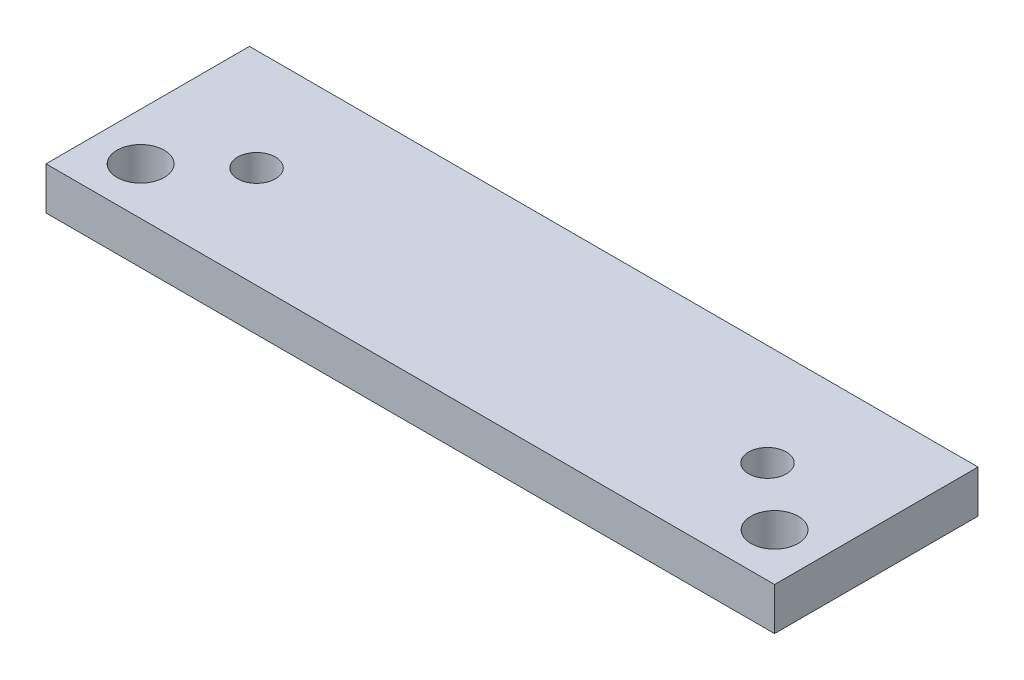
ISO-10303-21;
HEADER;
FILE_DESCRIPTION(('STEP AP214'),'2;1');
FILE_NAME('part.step','',(''),(''),'','','');
FILE_SCHEMA(('AUTOMOTIVE_DESIGN { 1 0 10303 214 1 1 1 1 }'));
ENDSEC;
DATA;
#1=APPLICATION_CONTEXT('core data for automotive mechanical design processes');
#2=APPLICATION_PROTOCOL_DEFINITION('international standard','automotive_design',2000,#1);
#3=PRODUCT_CONTEXT('',#1,'mechanical');
#4=PRODUCT('Part','Part','',(#3));
#5=PRODUCT_RELATED_PRODUCT_CATEGORY('part','',(#4));
#6=PRODUCT_DEFINITION_FORMATION('','',#4);
#7=PRODUCT_DEFINITION_CONTEXT('part definition',#1,'design');
#8=PRODUCT_DEFINITION('design','',#6,#7);
#9=PRODUCT_DEFINITION_SHAPE('','',#8);
#10=(LENGTH_UNIT() NAMED_UNIT(*) SI_UNIT(.MILLI.,.METRE.));
#11=(NAMED_UNIT(*) PLANE_ANGLE_UNIT() SI_UNIT($,.RADIAN.));
#12=(NAMED_UNIT(*) SI_UNIT($,.STERADIAN.) SOLID_ANGLE_UNIT());
#13=UNCERTAINTY_MEASURE_WITH_UNIT(LENGTH_MEASURE(1.E-05),#10,'distance_accuracy_value','');
#14=(GEOMETRIC_REPRESENTATION_CONTEXT(3) GLOBAL_UNCERTAINTY_ASSIGNED_CONTEXT((#13)) GLOBAL_UNIT_ASSIGNED_CONTEXT((#10,
#11,#12)) REPRESENTATION_CONTEXT('',''));
#15=CARTESIAN_POINT('',(0.,0.,0.));
#16=DIRECTION('',(0.,0.,1.));
#17=DIRECTION('',(1.,0.,0.));
#18=AXIS2_PLACEMENT_3D('',#15,#16,#17);
#19=CARTESIAN_POINT('',(0.,4.5,0.));
#20=DIRECTION('',(0.,-1.,0.));
#21=DIRECTION('',(0.,0.,-1.));
#22=AXIS2_PLACEMENT_3D('',#19,#20,#21);
#23=PLANE('',#22);
#24=DIRECTION('',(0.,0.,1.));
#25=VECTOR('',#24,1.);
#26=CARTESIAN_POINT('',(0.,4.5,0.));
#27=LINE('',#26,#25);
#28=CARTESIAN_POINT('',(0.,4.5,-21.5));
#29=VERTEX_POINT('',#28);
#30=CARTESIAN_POINT('',(0.,4.5,0.));
#31=VERTEX_POINT('',#30);
#32=EDGE_CURVE('E98',#29,#31,#27,.T.);
#33=ORIENTED_EDGE('',*,*,#32,.T.);
#34=DIRECTION('',(1.,0.,0.));
#35=VECTOR('',#34,1.);
#36=CARTESIAN_POINT('',(0.,4.5,0.));
#37=LINE('',#36,#35);
#38=CARTESIAN_POINT('',(77.,4.5,0.));
#39=VERTEX_POINT('',#38);
#40=EDGE_CURVE('E93',#31,#39,#37,.T.);
#41=ORIENTED_EDGE('',*,*,#40,.T.);
#42=DIRECTION('',(0.,0.,-1.));
#43=VECTOR('',#42,1.);
#44=CARTESIAN_POINT('',(77.,4.5,0.));
#45=LINE('',#44,#43);
#46=CARTESIAN_POINT('',(77.,4.5,-21.5));
#47=VERTEX_POINT('',#46);
#48=EDGE_CURVE('E96',#39,#47,#45,.T.);
#49=ORIENTED_EDGE('',*,*,#48,.T.);
#50=DIRECTION('',(-1.,0.,0.));
#51=VECTOR('',#50,1.);
#52=CARTESIAN_POINT('',(0.,4.5,-21.5));
#53=LINE('',#52,#51);
#54=EDGE_CURVE('E63',#47,#29,#53,.T.);
#55=ORIENTED_EDGE('',*,*,#54,.T.);
#56=EDGE_LOOP('',(#33,#41,#49,#55));
#57=FACE_BOUND('',#56,.T.);
#58=CARTESIAN_POINT('',(11.5,4.5,-10.75));
#59=DIRECTION('',(0.,1.,0.));
#60=DIRECTION('',(0.,0.,1.));
#61=AXIS2_PLACEMENT_3D('',#58,#59,#60);
#62=CIRCLE('',#61,2.);
#63=CARTESIAN_POINT('',(11.5,4.5,-8.75));
#64=VERTEX_POINT('',#63);
#65=EDGE_CURVE('E118',#64,#64,#62,.T.);
#66=ORIENTED_EDGE('',*,*,#65,.F.);
#67=EDGE_LOOP('',(#66));
#68=FACE_BOUND('',#67,.T.);
#69=CARTESIAN_POINT('',(65.5,4.5,-10.75));
#70=DIRECTION('',(0.,1.,0.));
#71=DIRECTION('',(0.,0.,-1.));
#72=AXIS2_PLACEMENT_3D('',#69,#70,#71);
#73=CIRCLE('',#72,2.);
#74=CARTESIAN_POINT('',(65.5,4.5,-12.75));
#75=VERTEX_POINT('',#74);
#76=EDGE_CURVE('E140',#75,#75,#73,.T.);
#77=ORIENTED_EDGE('',*,*,#76,.F.);
#78=EDGE_LOOP('',(#77));
#79=FACE_BOUND('',#78,.T.);
#80=CARTESIAN_POINT('',(5.,4.5,-5.));
#81=DIRECTION('',(0.,1.,0.));
#82=DIRECTION('',(0.,0.,1.));
#83=AXIS2_PLACEMENT_3D('',#80,#81,#82);
#84=CIRCLE('',#83,2.5);
#85=CARTESIAN_POINT('',(5.,4.5,-2.5));
#86=VERTEX_POINT('',#85);
#87=EDGE_CURVE('E148',#86,#86,#84,.T.);
#88=ORIENTED_EDGE('',*,*,#87,.F.);
#89=EDGE_LOOP('',(#88));
#90=FACE_BOUND('',#89,.T.);
#91=CARTESIAN_POINT('',(72.,4.5,-5.00000000000001));
#92=DIRECTION('',(0.,1.,0.));
#93=DIRECTION('',(0.,0.,-1.));
#94=AXIS2_PLACEMENT_3D('',#91,#92,#93);
#95=CIRCLE('',#94,2.50000000000001);
#96=CARTESIAN_POINT('',(72.,4.5,-7.50000000000002));
#97=VERTEX_POINT('',#96);
#98=EDGE_CURVE('E156',#97,#97,#95,.T.);
#99=ORIENTED_EDGE('',*,*,#98,.F.);
#100=EDGE_LOOP('',(#99));
#101=FACE_BOUND('',#100,.T.);
#102=ADVANCED_FACE('F45',(#57,#68,#79,#90,#101),#23,.F.);
#103=CARTESIAN_POINT('',(0.,0.,0.));
#104=DIRECTION('',(0.,-1.,0.));
#105=DIRECTION('',(0.,0.,-1.));
#106=AXIS2_PLACEMENT_3D('',#103,#104,#105);
#107=PLANE('',#106);
#108=CARTESIAN_POINT('',(5.,0.,-5.));
#109=DIRECTION('',(0.,1.,0.));
#110=DIRECTION('',(0.,0.,1.));
#111=AXIS2_PLACEMENT_3D('',#108,#109,#110);
#112=CIRCLE('',#111,2.5);
#113=CARTESIAN_POINT('',(5.,0.,-2.5));
#114=VERTEX_POINT('',#113);
#115=EDGE_CURVE('E152',#114,#114,#112,.T.);
#116=ORIENTED_EDGE('',*,*,#115,.T.);
#117=EDGE_LOOP('',(#116));
#118=FACE_BOUND('',#117,.T.);
#119=CARTESIAN_POINT('',(11.5,0.,-10.75));
#120=DIRECTION('',(0.,1.,0.));
#121=DIRECTION('',(0.,0.,1.));
#122=AXIS2_PLACEMENT_3D('',#119,#120,#121);
#123=CIRCLE('',#122,2.);
#124=CARTESIAN_POINT('',(11.5,0.,-8.75));
#125=VERTEX_POINT('',#124);
#126=EDGE_CURVE('E136',#125,#125,#123,.T.);
#127=ORIENTED_EDGE('',*,*,#126,.T.);
#128=EDGE_LOOP('',(#127));
#129=FACE_BOUND('',#128,.T.);
#130=DIRECTION('',(0.,0.,1.));
#131=VECTOR('',#130,1.);
#132=CARTESIAN_POINT('',(0.,0.,0.));
#133=LINE('',#132,#131);
#134=CARTESIAN_POINT('',(0.,0.,-21.5));
#135=VERTEX_POINT('',#134);
#136=CARTESIAN_POINT('',(0.,0.,0.));
#137=VERTEX_POINT('',#136);
#138=EDGE_CURVE('E114',#135,#137,#133,.T.);
#139=ORIENTED_EDGE('',*,*,#138,.F.);
#140=DIRECTION('',(-1.,0.,0.));
#141=VECTOR('',#140,1.);
#142=CARTESIAN_POINT('',(0.,0.,-21.5));
#143=LINE('',#142,#141);
#144=CARTESIAN_POINT('',(77.,0.,-21.5));
#145=VERTEX_POINT('',#144);
#146=EDGE_CURVE('E86',#145,#135,#143,.T.);
#147=ORIENTED_EDGE('',*,*,#146,.F.);
#148=DIRECTION('',(0.,0.,-1.));
#149=VECTOR('',#148,1.);
#150=CARTESIAN_POINT('',(77.,0.,0.));
#151=LINE('',#150,#149);
#152=CARTESIAN_POINT('',(77.,0.,0.));
#153=VERTEX_POINT('',#152);
#154=EDGE_CURVE('E80',#153,#145,#151,.T.);
#155=ORIENTED_EDGE('',*,*,#154,.F.);
#156=DIRECTION('',(1.,0.,0.));
#157=VECTOR('',#156,1.);
#158=CARTESIAN_POINT('',(0.,0.,0.));
#159=LINE('',#158,#157);
#160=EDGE_CURVE('E103',#137,#153,#159,.T.);
#161=ORIENTED_EDGE('',*,*,#160,.F.);
#162=EDGE_LOOP('',(#139,#147,#155,#161));
#163=FACE_BOUND('',#162,.T.);
#164=CARTESIAN_POINT('',(65.5,0.,-10.75));
#165=DIRECTION('',(0.,1.,0.));
#166=DIRECTION('',(0.,0.,-1.));
#167=AXIS2_PLACEMENT_3D('',#164,#165,#166);
#168=CIRCLE('',#167,2.);
#169=CARTESIAN_POINT('',(65.5,0.,-12.75));
#170=VERTEX_POINT('',#169);
#171=EDGE_CURVE('E144',#170,#170,#168,.T.);
#172=ORIENTED_EDGE('',*,*,#171,.T.);
#173=EDGE_LOOP('',(#172));
#174=FACE_BOUND('',#173,.T.);
#175=CARTESIAN_POINT('',(72.,0.,-5.00000000000001));
#176=DIRECTION('',(0.,1.,0.));
#177=DIRECTION('',(0.,0.,-1.));
#178=AXIS2_PLACEMENT_3D('',#175,#176,#177);
#179=CIRCLE('',#178,2.50000000000001);
#180=CARTESIAN_POINT('',(72.,0.,-7.50000000000002));
#181=VERTEX_POINT('',#180);
#182=EDGE_CURVE('E160',#181,#181,#179,.T.);
#183=ORIENTED_EDGE('',*,*,#182,.T.);
#184=EDGE_LOOP('',(#183));
#185=FACE_BOUND('',#184,.T.);
#186=ADVANCED_FACE('F131',(#118,#129,#163,#174,#185),#107,.T.);
#187=CARTESIAN_POINT('',(0.,4.5,0.));
#188=DIRECTION('',(1.,0.,0.));
#189=DIRECTION('',(0.,0.,-1.));
#190=AXIS2_PLACEMENT_3D('',#187,#188,#189);
#191=PLANE('',#190);
#192=ORIENTED_EDGE('',*,*,#138,.T.);
#193=DIRECTION('',(0.,-1.,0.));
#194=VECTOR('',#193,1.);
#195=CARTESIAN_POINT('',(0.,4.5,0.));
#196=LINE('',#195,#194);
#197=EDGE_CURVE('E11',#31,#137,#196,.T.);
#198=ORIENTED_EDGE('',*,*,#197,.F.);
#199=ORIENTED_EDGE('',*,*,#32,.F.);
#200=DIRECTION('',(0.,-1.,0.));
#201=VECTOR('',#200,1.);
#202=CARTESIAN_POINT('',(0.,4.5,-21.5));
#203=LINE('',#202,#201);
#204=EDGE_CURVE('E110',#29,#135,#203,.T.);
#205=ORIENTED_EDGE('',*,*,#204,.T.);
#206=EDGE_LOOP('',(#192,#198,#199,#205));
#207=FACE_BOUND('',#206,.T.);
#208=ADVANCED_FACE('F47',(#207),#191,.F.);
#209=CARTESIAN_POINT('',(0.,4.5,0.));
#210=DIRECTION('',(0.,0.,-1.));
#211=DIRECTION('',(-1.,0.,0.));
#212=AXIS2_PLACEMENT_3D('',#209,#210,#211);
#213=PLANE('',#212);
#214=ORIENTED_EDGE('',*,*,#160,.T.);
#215=DIRECTION('',(0.,-1.,0.));
#216=VECTOR('',#215,1.);
#217=CARTESIAN_POINT('',(77.,4.5,0.));
#218=LINE('',#217,#216);
#219=EDGE_CURVE('E55',#39,#153,#218,.T.);
#220=ORIENTED_EDGE('',*,*,#219,.F.);
#221=ORIENTED_EDGE('',*,*,#40,.F.);
#222=ORIENTED_EDGE('',*,*,#197,.T.);
#223=EDGE_LOOP('',(#214,#220,#221,#222));
#224=FACE_BOUND('',#223,.T.);
#225=ADVANCED_FACE('F102',(#224),#213,.F.);
#226=CARTESIAN_POINT('',(77.,4.5,0.));
#227=DIRECTION('',(-1.,0.,0.));
#228=DIRECTION('',(0.,0.,1.));
#229=AXIS2_PLACEMENT_3D('',#226,#227,#228);
#230=PLANE('',#229);
#231=ORIENTED_EDGE('',*,*,#154,.T.);
#232=DIRECTION('',(0.,-1.,0.));
#233=VECTOR('',#232,1.);
#234=CARTESIAN_POINT('',(77.,4.5,-21.5));
#235=LINE('',#234,#233);
#236=EDGE_CURVE('E105',#47,#145,#235,.T.);
#237=ORIENTED_EDGE('',*,*,#236,.F.);
#238=ORIENTED_EDGE('',*,*,#48,.F.);
#239=ORIENTED_EDGE('',*,*,#219,.T.);
#240=EDGE_LOOP('',(#231,#237,#238,#239));
#241=FACE_BOUND('',#240,.T.);
#242=ADVANCED_FACE('F106',(#241),#230,.F.);
#243=CARTESIAN_POINT('',(0.,4.5,-21.5));
#244=DIRECTION('',(0.,0.,1.));
#245=DIRECTION('',(1.,0.,0.));
#246=AXIS2_PLACEMENT_3D('',#243,#244,#245);
#247=PLANE('',#246);
#248=ORIENTED_EDGE('',*,*,#146,.T.);
#249=ORIENTED_EDGE('',*,*,#204,.F.);
#250=ORIENTED_EDGE('',*,*,#54,.F.);
#251=ORIENTED_EDGE('',*,*,#236,.T.);
#252=EDGE_LOOP('',(#248,#249,#250,#251));
#253=FACE_BOUND('',#252,.T.);
#254=ADVANCED_FACE('F128',(#253),#247,.F.);
#255=CARTESIAN_POINT('',(11.5,4.5,-10.75));
#256=DIRECTION('',(0.,-1.,0.));
#257=DIRECTION('',(0.,0.,-1.));
#258=AXIS2_PLACEMENT_3D('',#255,#256,#257);
#259=CYLINDRICAL_SURFACE('',#258,2.);
#260=ORIENTED_EDGE('',*,*,#65,.T.);
#261=EDGE_LOOP('',(#260));
#262=FACE_BOUND('',#261,.T.);
#263=ORIENTED_EDGE('',*,*,#126,.F.);
#264=EDGE_LOOP('',(#263));
#265=FACE_BOUND('',#264,.T.);
#266=ADVANCED_FACE('F179',(#262,#265),#259,.F.);
#267=CARTESIAN_POINT('',(65.5,4.5,-10.75));
#268=DIRECTION('',(0.,-1.,0.));
#269=DIRECTION('',(0.,0.,-1.));
#270=AXIS2_PLACEMENT_3D('',#267,#268,#269);
#271=CYLINDRICAL_SURFACE('',#270,2.);
#272=ORIENTED_EDGE('',*,*,#76,.T.);
#273=EDGE_LOOP('',(#272));
#274=FACE_BOUND('',#273,.T.);
#275=ORIENTED_EDGE('',*,*,#171,.F.);
#276=EDGE_LOOP('',(#275));
#277=FACE_BOUND('',#276,.T.);
#278=ADVANCED_FACE('F233',(#274,#277),#271,.F.);
#279=CARTESIAN_POINT('',(5.,4.5,-5.));
#280=DIRECTION('',(0.,-1.,0.));
#281=DIRECTION('',(0.,0.,-1.));
#282=AXIS2_PLACEMENT_3D('',#279,#280,#281);
#283=CYLINDRICAL_SURFACE('',#282,2.5);
#284=ORIENTED_EDGE('',*,*,#87,.T.);
#285=EDGE_LOOP('',(#284));
#286=FACE_BOUND('',#285,.T.);
#287=ORIENTED_EDGE('',*,*,#115,.F.);
#288=EDGE_LOOP('',(#287));
#289=FACE_BOUND('',#288,.T.);
#290=ADVANCED_FACE('F242',(#286,#289),#283,.F.);
#291=CARTESIAN_POINT('',(72.,4.5,-5.00000000000001));
#292=DIRECTION('',(0.,-1.,0.));
#293=DIRECTION('',(0.,0.,-1.));
#294=AXIS2_PLACEMENT_3D('',#291,#292,#293);
#295=CYLINDRICAL_SURFACE('',#294,2.50000000000001);
#296=ORIENTED_EDGE('',*,*,#98,.T.);
#297=EDGE_LOOP('',(#296));
#298=FACE_BOUND('',#297,.T.);
#299=ORIENTED_EDGE('',*,*,#182,.F.);
#300=EDGE_LOOP('',(#299));
#301=FACE_BOUND('',#300,.T.);
#302=ADVANCED_FACE('F168',(#298,#301),#295,.F.);
#303=CLOSED_SHELL('',(#102,#186,#208,#225,#242,#254,#266,#278,#290,#302));
#304=MANIFOLD_SOLID_BREP('B2',#303);
#305=ADVANCED_BREP_SHAPE_REPRESENTATION('',(#18,#304),#14);
#306=SHAPE_DEFINITION_REPRESENTATION(#9,#305);
ENDSEC;
END-ISO-10303-21;
